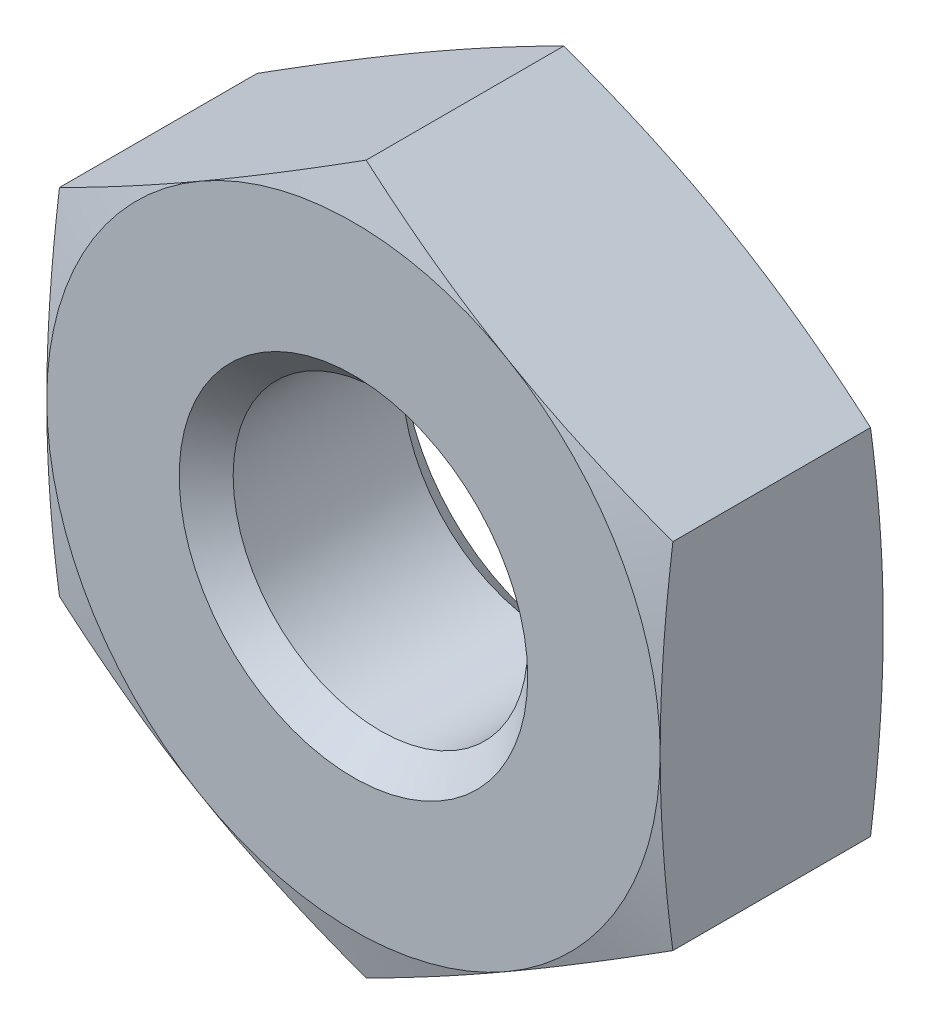
ISO-10303-21;
HEADER;
FILE_DESCRIPTION(('STEP AP214'),'2;1');
FILE_NAME('part.step','',(''),(''),'','','');
FILE_SCHEMA(('AUTOMOTIVE_DESIGN { 1 0 10303 214 1 1 1 1 }'));
ENDSEC;
DATA;
#1=APPLICATION_CONTEXT('core data for automotive mechanical design processes');
#2=APPLICATION_PROTOCOL_DEFINITION('international standard','automotive_design',2000,#1);
#3=PRODUCT_CONTEXT('',#1,'mechanical');
#4=PRODUCT('Part','Part','',(#3));
#5=PRODUCT_RELATED_PRODUCT_CATEGORY('part','',(#4));
#6=PRODUCT_DEFINITION_FORMATION('','',#4);
#7=PRODUCT_DEFINITION_CONTEXT('part definition',#1,'design');
#8=PRODUCT_DEFINITION('design','',#6,#7);
#9=PRODUCT_DEFINITION_SHAPE('','',#8);
#10=(LENGTH_UNIT() NAMED_UNIT(*) SI_UNIT(.MILLI.,.METRE.));
#11=(NAMED_UNIT(*) PLANE_ANGLE_UNIT() SI_UNIT($,.RADIAN.));
#12=(NAMED_UNIT(*) SI_UNIT($,.STERADIAN.) SOLID_ANGLE_UNIT());
#13=UNCERTAINTY_MEASURE_WITH_UNIT(LENGTH_MEASURE(1.E-05),#10,'distance_accuracy_value','');
#14=(GEOMETRIC_REPRESENTATION_CONTEXT(3) GLOBAL_UNCERTAINTY_ASSIGNED_CONTEXT((#13)) GLOBAL_UNIT_ASSIGNED_CONTEXT((#10,
#11,#12)) REPRESENTATION_CONTEXT('',''));
#15=CARTESIAN_POINT('',(0.,0.,0.));
#16=DIRECTION('',(0.,0.,1.));
#17=DIRECTION('',(1.,0.,0.));
#18=AXIS2_PLACEMENT_3D('',#15,#16,#17);
#19=CARTESIAN_POINT('',(0.,5.588,-4.064));
#20=DIRECTION('',(0.,0.,1.));
#21=DIRECTION('',(1.,0.,0.));
#22=AXIS2_PLACEMENT_3D('',#19,#20,#21);
#23=PLANE('',#22);
#24=CARTESIAN_POINT('',(0.,0.,-4.064000000026));
#25=DIRECTION('',(0.,0.,1.));
#26=DIRECTION('',(1.,0.,0.));
#27=AXIS2_PLACEMENT_3D('',#24,#25,#26);
#28=CIRCLE('',#27,5.58799999998882);
#29=CARTESIAN_POINT('',(2.7939999999972,4.83934995634261,-4.06400000002451));
#30=VERTEX_POINT('',#29);
#31=CARTESIAN_POINT('',(-2.7939999999972,4.8393499563426,-4.06400000002451));
#32=VERTEX_POINT('',#31);
#33=EDGE_CURVE('E130',#30,#32,#28,.T.);
#34=ORIENTED_EDGE('',*,*,#33,.F.);
#35=CARTESIAN_POINT('',(0.,0.,-4.064000000026));
#36=DIRECTION('',(0.,0.,1.));
#37=DIRECTION('',(1.,0.,0.));
#38=AXIS2_PLACEMENT_3D('',#35,#36,#37);
#39=CIRCLE('',#38,5.58799999998882);
#40=CARTESIAN_POINT('',(5.58799999999441,0.,-4.06400000002451));
#41=VERTEX_POINT('',#40);
#42=EDGE_CURVE('E127',#41,#30,#39,.T.);
#43=ORIENTED_EDGE('',*,*,#42,.F.);
#44=CARTESIAN_POINT('',(0.,0.,-4.064000000026));
#45=DIRECTION('',(0.,0.,1.));
#46=DIRECTION('',(1.,0.,0.));
#47=AXIS2_PLACEMENT_3D('',#44,#45,#46);
#48=CIRCLE('',#47,5.58799999998882);
#49=CARTESIAN_POINT('',(2.7939999999972,-4.83934995634261,-4.06400000002451));
#50=VERTEX_POINT('',#49);
#51=EDGE_CURVE('E19',#50,#41,#48,.T.);
#52=ORIENTED_EDGE('',*,*,#51,.F.);
#53=CARTESIAN_POINT('',(0.,0.,-4.064000000026));
#54=DIRECTION('',(0.,0.,1.));
#55=DIRECTION('',(1.,0.,0.));
#56=AXIS2_PLACEMENT_3D('',#53,#54,#55);
#57=CIRCLE('',#56,5.58799999998882);
#58=CARTESIAN_POINT('',(-2.7939999999972,-4.83934995634261,-4.06400000002451));
#59=VERTEX_POINT('',#58);
#60=EDGE_CURVE('E103',#59,#50,#57,.T.);
#61=ORIENTED_EDGE('',*,*,#60,.F.);
#62=CARTESIAN_POINT('',(0.,0.,-4.064000000026));
#63=DIRECTION('',(0.,0.,1.));
#64=DIRECTION('',(1.,0.,0.));
#65=AXIS2_PLACEMENT_3D('',#62,#63,#64);
#66=CIRCLE('',#65,5.58799999998882);
#67=CARTESIAN_POINT('',(-5.58799999999441,0.,-4.06400000002451));
#68=VERTEX_POINT('',#67);
#69=EDGE_CURVE('E135',#68,#59,#66,.T.);
#70=ORIENTED_EDGE('',*,*,#69,.F.);
#71=CARTESIAN_POINT('',(0.,0.,-4.064000000026));
#72=DIRECTION('',(0.,0.,1.));
#73=DIRECTION('',(1.,0.,0.));
#74=AXIS2_PLACEMENT_3D('',#71,#72,#73);
#75=CIRCLE('',#74,5.58799999998882);
#76=EDGE_CURVE('E411',#32,#68,#75,.T.);
#77=ORIENTED_EDGE('',*,*,#76,.F.);
#78=EDGE_LOOP('',(#34,#43,#52,#61,#70,#77));
#79=FACE_BOUND('',#78,.T.);
#80=CARTESIAN_POINT('',(0.,0.,-4.06400000002805));
#81=DIRECTION('',(0.,0.,-1.));
#82=DIRECTION('',(-1.,0.,0.));
#83=AXIS2_PLACEMENT_3D('',#80,#81,#82);
#84=CIRCLE('',#83,3.17499999999882);
#85=CARTESIAN_POINT('',(-3.17499999999882,0.,-4.06400000002805));
#86=VERTEX_POINT('',#85);
#87=EDGE_CURVE('E124',#86,#86,#84,.F.);
#88=ORIENTED_EDGE('',*,*,#87,.T.);
#89=EDGE_LOOP('',(#88));
#90=FACE_BOUND('',#89,.T.);
#91=ADVANCED_FACE('F16',(#79,#90),#23,.F.);
#92=CARTESIAN_POINT('',(0.,0.,-3.83097707165803));
#93=DIRECTION('',(0.,0.,1.));
#94=DIRECTION('',(1.,0.,0.));
#95=AXIS2_PLACEMENT_3D('',#92,#93,#94);
#96=CONICAL_SURFACE('',#95,6.45765340800608,1.30899693900135);
#97=CARTESIAN_POINT('',(2.79399999999999,-4.83934995634744,-4.06400000002301));
#98=CARTESIAN_POINT('',(2.91089048197917,-4.77186320511105,-4.06400613805041));
#99=CARTESIAN_POINT('',(3.02777767203443,-4.70437835446783,-4.06268908124278));
#100=CARTESIAN_POINT('',(3.26150490328894,-4.56943587458609,-4.0574605147276));
#101=CARTESIAN_POINT('',(3.3783449458841,-4.50197824454165,-4.05354908849101));
#102=CARTESIAN_POINT('',(3.72847238563638,-4.29983207295,-4.03801311347));
#103=CARTESIAN_POINT('',(3.96163987483682,-4.16521276029386,-4.02258663373282));
#104=CARTESIAN_POINT('',(4.42730452197151,-3.89636115091855,-3.98253825882312));
#105=CARTESIAN_POINT('',(4.65980182496363,-3.76212877045019,-3.95791853210183));
#106=CARTESIAN_POINT('',(5.12433854928225,-3.49392836761637,-3.90075946318869));
#107=CARTESIAN_POINT('',(5.35637714733395,-3.35996082056883,-3.86821113150756));
#108=CARTESIAN_POINT('',(5.58800000000257,-3.22623330423014,-3.8323668704064));
#109=B_SPLINE_CURVE_WITH_KNOTS('',3,(#97,#98,#99,#100,#101,#102,#103,#104,#105,#106,#107,#108),
.UNSPECIFIED.,.F.,.F.,(4,2,2,2,2,4),(0.,0.404906880860233,0.809800734922586,1.61864413081672,
2.42729686168546,3.23687074950759),.UNSPECIFIED.);
#110=CARTESIAN_POINT('',(5.58800000000161,-3.22623330423255,-3.8323668704063));
#111=VERTEX_POINT('',#110);
#112=EDGE_CURVE('E114',#50,#111,#109,.T.);
#113=ORIENTED_EDGE('',*,*,#112,.F.);
#114=ORIENTED_EDGE('',*,*,#51,.T.);
#115=CARTESIAN_POINT('',(5.58799999999305,-3.22623330423461,-3.83236687040081));
#116=CARTESIAN_POINT('',(5.58799999999751,-2.95877827155755,-3.86821113150552));
#117=CARTESIAN_POINT('',(5.58799999999933,-2.69084317746257,-3.9007594631881));
#118=CARTESIAN_POINT('',(5.58800000000067,-2.1544423717949,-3.95791853210232));
#119=CARTESIAN_POINT('',(5.58800000000018,-1.88597761085806,-3.98253825882323));
#120=CARTESIAN_POINT('',(5.58799999999983,-1.34827439210734,-4.02258663373267));
#121=CARTESIAN_POINT('',(5.58799999999997,-1.07903576679505,-4.03801311346996));
#122=CARTESIAN_POINT('',(5.58800000000002,-0.674743423611711,-4.05354908849102));
#123=CARTESIAN_POINT('',(5.58800000000001,-0.539828163522803,-4.05746051472761));
#124=CARTESIAN_POINT('',(5.58799999999999,-0.269943203759274,-4.06268908124277));
#125=CARTESIAN_POINT('',(5.58799999999998,-0.134973502472803,-4.0640061380504));
#126=CARTESIAN_POINT('',(5.588,0.,-4.06400000002301));
#127=B_SPLINE_CURVE_WITH_KNOTS('',3,(#115,#116,#117,#118,#119,#120,#121,#122,#123,#124,#125,
#126),.UNSPECIFIED.,.F.,.F.,(4,2,2,2,2,4),(0.,0.809573887822391,1.61822661869133,
2.42707001458552,2.83196386864794,3.23687074950825),.UNSPECIFIED.);
#128=EDGE_CURVE('E112',#111,#41,#127,.T.);
#129=ORIENTED_EDGE('',*,*,#128,.F.);
#130=EDGE_LOOP('',(#113,#114,#129));
#131=FACE_BOUND('',#130,.T.);
#132=ADVANCED_FACE('F111',(#131),#96,.T.);
#133=CARTESIAN_POINT('',(0.,0.,-3.83097707165803));
#134=DIRECTION('',(0.,0.,1.));
#135=DIRECTION('',(1.,0.,0.));
#136=AXIS2_PLACEMENT_3D('',#133,#134,#135);
#137=CONICAL_SURFACE('',#136,6.45765340800608,1.30899693900135);
#138=CARTESIAN_POINT('',(-2.794,-4.83934995634745,-4.06400000002301));
#139=CARTESIAN_POINT('',(-2.67710951802081,-4.90683670758384,-4.06400613805041));
#140=CARTESIAN_POINT('',(-2.56022232796556,-4.97432155822706,-4.06268908124278));
#141=CARTESIAN_POINT('',(-2.32649509671105,-5.1092640381088,-4.0574605147276));
#142=CARTESIAN_POINT('',(-2.20965505411589,-5.17672166815324,-4.05354908849101));
#143=CARTESIAN_POINT('',(-1.85952761436361,-5.37886783974489,-4.03801311347));
#144=CARTESIAN_POINT('',(-1.62636012516317,-5.51348715240103,-4.02258663373282));
#145=CARTESIAN_POINT('',(-1.16069547802849,-5.78233876177633,-3.98253825882312));
#146=CARTESIAN_POINT('',(-0.928198175036369,-5.9165711422447,-3.95791853210183));
#147=CARTESIAN_POINT('',(-0.46366145071775,-6.18477154507852,-3.90075946318868));
#148=CARTESIAN_POINT('',(-0.231622852666047,-6.31873909212605,-3.86821113150756));
#149=CARTESIAN_POINT('',(2.5725689760497E-12,-6.45246660846475,-3.8323668704064));
#150=B_SPLINE_CURVE_WITH_KNOTS('',3,(#138,#139,#140,#141,#142,#143,#144,#145,#146,#147,#148,
#149),.UNSPECIFIED.,.F.,.F.,(4,2,2,2,2,4),(0.,0.404906880860231,0.809800734922583,
1.61864413081671,2.42729686168545,3.23687074950758),.UNSPECIFIED.);
#151=CARTESIAN_POINT('',(0.,-6.45246660846511,-3.8323668704063));
#152=VERTEX_POINT('',#151);
#153=EDGE_CURVE('E275',#59,#152,#150,.T.);
#154=ORIENTED_EDGE('',*,*,#153,.F.);
#155=ORIENTED_EDGE('',*,*,#60,.T.);
#156=CARTESIAN_POINT('',(-6.06003807704887E-12,-6.45246660845872,-3.83236687040082));
#157=CARTESIAN_POINT('',(0.231622852664497,-6.31873909212406,-3.86821113150552));
#158=CARTESIAN_POINT('',(0.463661450717038,-6.18477154507814,-3.9007594631881));
#159=CARTESIAN_POINT('',(0.928198175036345,-5.91657114224546,-3.95791853210233));
#160=CARTESIAN_POINT('',(1.16069547802832,-5.78233876177662,-3.98253825882324));
#161=CARTESIAN_POINT('',(1.62636012516292,-5.51348715240096,-4.02258663373267));
#162=CARTESIAN_POINT('',(1.85952761436344,-5.37886783974494,-4.03801311346997));
#163=CARTESIAN_POINT('',(2.20965505411577,-5.17672166815331,-4.05354908849102));
#164=CARTESIAN_POINT('',(2.32649509671095,-5.10926403810885,-4.05746051472761));
#165=CARTESIAN_POINT('',(2.56022232796549,-4.97432155822707,-4.06268908124278));
#166=CARTESIAN_POINT('',(2.67710951802077,-4.90683670758383,-4.0640061380504));
#167=CARTESIAN_POINT('',(2.79399999999999,-4.83934995634744,-4.06400000002301));
#168=B_SPLINE_CURVE_WITH_KNOTS('',3,(#156,#157,#158,#159,#160,#161,#162,#163,#164,#165,#166,
#167),.UNSPECIFIED.,.F.,.F.,(4,2,2,2,2,4),(0.,0.809573887822391,1.61822661869133,
2.42707001458551,2.83196386864793,3.23687074950825),.UNSPECIFIED.);
#169=EDGE_CURVE('E139',#152,#50,#168,.T.);
#170=ORIENTED_EDGE('',*,*,#169,.F.);
#171=EDGE_LOOP('',(#154,#155,#170));
#172=FACE_BOUND('',#171,.T.);
#173=ADVANCED_FACE('F288',(#172),#137,.T.);
#174=CARTESIAN_POINT('',(0.,0.,-3.83097707165803));
#175=DIRECTION('',(0.,0.,1.));
#176=DIRECTION('',(1.,0.,0.));
#177=AXIS2_PLACEMENT_3D('',#174,#175,#176);
#178=CONICAL_SURFACE('',#177,6.45765340800608,1.30899693900135);
#179=ORIENTED_EDGE('',*,*,#69,.T.);
#180=CARTESIAN_POINT('',(-5.5879999999991,-3.22623330422413,-3.83236687040081));
#181=CARTESIAN_POINT('',(-5.35637714733301,-3.35996082056652,-3.86821113150551));
#182=CARTESIAN_POINT('',(-5.12433854928229,-3.49392836761559,-3.9007594631881));
#183=CARTESIAN_POINT('',(-4.65980182496431,-3.76212877045058,-3.95791853210232));
#184=CARTESIAN_POINT('',(-4.42730452197185,-3.89636115091857,-3.98253825882323));
#185=CARTESIAN_POINT('',(-3.96163987483689,-4.16521276029363,-4.02258663373267));
#186=CARTESIAN_POINT('',(-3.72847238563652,-4.29983207294989,-4.03801311346996));
#187=CARTESIAN_POINT('',(-3.37834494588424,-4.50197824454161,-4.05354908849102));
#188=CARTESIAN_POINT('',(-3.26150490328905,-4.56943587458606,-4.05746051472761));
#189=CARTESIAN_POINT('',(-3.02777767203448,-4.70437835446781,-4.06268908124277));
#190=CARTESIAN_POINT('',(-2.9108904819792,-4.77186320511103,-4.0640061380504));
#191=CARTESIAN_POINT('',(-2.794,-4.83934995634745,-4.06400000002301));
#192=B_SPLINE_CURVE_WITH_KNOTS('',3,(#180,#181,#182,#183,#184,#185,#186,#187,#188,#189,#190,
#191),.UNSPECIFIED.,.F.,.F.,(4,2,2,2,2,4),(0.,0.809573887822391,1.61822661869133,
2.42707001458552,2.83196386864794,3.23687074950825),.UNSPECIFIED.);
#193=CARTESIAN_POINT('',(-5.58800000000161,-3.22623330423256,-3.8323668704063));
#194=VERTEX_POINT('',#193);
#195=EDGE_CURVE('E280',#194,#59,#192,.T.);
#196=ORIENTED_EDGE('',*,*,#195,.F.);
#197=CARTESIAN_POINT('',(-5.588,0.,-4.06400000002301));
#198=CARTESIAN_POINT('',(-5.588,-0.134973502472776,-4.06400613805041));
#199=CARTESIAN_POINT('',(-5.588,-0.269943203759218,-4.06268908124278));
#200=CARTESIAN_POINT('',(-5.588,-0.539828163522696,-4.0574605147276));
#201=CARTESIAN_POINT('',(-5.588,-0.674743423611582,-4.05354908849101));
#202=CARTESIAN_POINT('',(-5.588,-1.07903576679489,-4.03801311347));
#203=CARTESIAN_POINT('',(-5.588,-1.34827439210717,-4.02258663373282));
#204=CARTESIAN_POINT('',(-5.588,-1.88597761085778,-3.98253825882312));
#205=CARTESIAN_POINT('',(-5.588,-2.1544423717945,-3.95791853210183));
#206=CARTESIAN_POINT('',(-5.588,-2.69084317746215,-3.90075946318868));
#207=CARTESIAN_POINT('',(-5.588,-2.95877827155722,-3.86821113150756));
#208=CARTESIAN_POINT('',(-5.588,-3.22623330423461,-3.8323668704064));
#209=B_SPLINE_CURVE_WITH_KNOTS('',3,(#197,#198,#199,#200,#201,#202,#203,#204,#205,#206,#207,
#208),.UNSPECIFIED.,.F.,.F.,(4,2,2,2,2,4),(0.,0.404906880860233,0.809800734922587,
1.61864413081672,2.42729686168547,3.23687074950759),.UNSPECIFIED.);
#210=EDGE_CURVE('E182',#68,#194,#209,.T.);
#211=ORIENTED_EDGE('',*,*,#210,.F.);
#212=EDGE_LOOP('',(#179,#196,#211));
#213=FACE_BOUND('',#212,.T.);
#214=ADVANCED_FACE('F164',(#213),#178,.T.);
#215=CARTESIAN_POINT('',(0.,0.,-3.83097707165803));
#216=DIRECTION('',(0.,0.,1.));
#217=DIRECTION('',(1.,0.,0.));
#218=AXIS2_PLACEMENT_3D('',#215,#216,#217);
#219=CONICAL_SURFACE('',#218,6.45765340800608,1.30899693900135);
#220=CARTESIAN_POINT('',(5.588,0.,-4.06400000002301));
#221=CARTESIAN_POINT('',(5.588,0.134973502472776,-4.06400613805041));
#222=CARTESIAN_POINT('',(5.588,0.269943203759219,-4.06268908124278));
#223=CARTESIAN_POINT('',(5.588,0.539828163522697,-4.0574605147276));
#224=CARTESIAN_POINT('',(5.588,0.674743423611582,-4.05354908849101));
#225=CARTESIAN_POINT('',(5.588,1.07903576679489,-4.03801311347));
#226=CARTESIAN_POINT('',(5.588,1.34827439210717,-4.02258663373282));
#227=CARTESIAN_POINT('',(5.588,1.88597761085778,-3.98253825882312));
#228=CARTESIAN_POINT('',(5.588,2.1544423717945,-3.95791853210183));
#229=CARTESIAN_POINT('',(5.588,2.69084317746215,-3.90075946318868));
#230=CARTESIAN_POINT('',(5.588,2.95877827155722,-3.86821113150756));
#231=CARTESIAN_POINT('',(5.588,3.22623330423461,-3.8323668704064));
#232=B_SPLINE_CURVE_WITH_KNOTS('',3,(#220,#221,#222,#223,#224,#225,#226,#227,#228,#229,#230,
#231),.UNSPECIFIED.,.F.,.F.,(4,2,2,2,2,4),(0.,0.404906880860234,0.809800734922587,
1.61864413081672,2.42729686168547,3.23687074950759),.UNSPECIFIED.);
#233=CARTESIAN_POINT('',(5.588,3.22623330423349,-3.83236687040655));
#234=VERTEX_POINT('',#233);
#235=EDGE_CURVE('E120',#41,#234,#232,.T.);
#236=ORIENTED_EDGE('',*,*,#235,.F.);
#237=ORIENTED_EDGE('',*,*,#42,.T.);
#238=CARTESIAN_POINT('',(5.5879999999991,3.22623330422413,-3.83236687040081));
#239=CARTESIAN_POINT('',(5.356377147333,3.35996082056652,-3.86821113150551));
#240=CARTESIAN_POINT('',(5.12433854928229,3.49392836761559,-3.9007594631881));
#241=CARTESIAN_POINT('',(4.65980182496431,3.76212877045058,-3.95791853210232));
#242=CARTESIAN_POINT('',(4.42730452197185,3.89636115091857,-3.98253825882323));
#243=CARTESIAN_POINT('',(3.96163987483689,4.16521276029363,-4.02258663373267));
#244=CARTESIAN_POINT('',(3.72847238563652,4.29983207294989,-4.03801311346996));
#245=CARTESIAN_POINT('',(3.37834494588423,4.50197824454161,-4.05354908849102));
#246=CARTESIAN_POINT('',(3.26150490328905,4.56943587458606,-4.05746051472761));
#247=CARTESIAN_POINT('',(3.02777767203448,4.70437835446781,-4.06268908124277));
#248=CARTESIAN_POINT('',(2.9108904819792,4.77186320511104,-4.0640061380504));
#249=CARTESIAN_POINT('',(2.794,4.83934995634745,-4.06400000002301));
#250=B_SPLINE_CURVE_WITH_KNOTS('',3,(#238,#239,#240,#241,#242,#243,#244,#245,#246,#247,#248,
#249),.UNSPECIFIED.,.F.,.F.,(4,2,2,2,2,4),(0.,0.809573887822392,1.61822661869133,
2.42707001458552,2.83196386864794,3.23687074950826),.UNSPECIFIED.);
#251=EDGE_CURVE('E138',#234,#30,#250,.T.);
#252=ORIENTED_EDGE('',*,*,#251,.F.);
#253=EDGE_LOOP('',(#236,#237,#252));
#254=FACE_BOUND('',#253,.T.);
#255=ADVANCED_FACE('F137',(#254),#219,.T.);
#256=CARTESIAN_POINT('',(0.,0.,-3.83097707165803));
#257=DIRECTION('',(0.,0.,1.));
#258=DIRECTION('',(1.,0.,0.));
#259=AXIS2_PLACEMENT_3D('',#256,#257,#258);
#260=CONICAL_SURFACE('',#259,6.45765340800608,1.30899693900135);
#261=CARTESIAN_POINT('',(2.794,4.83934995634745,-4.06400000002301));
#262=CARTESIAN_POINT('',(2.67710951802081,4.90683670758384,-4.06400613805041));
#263=CARTESIAN_POINT('',(2.56022232796556,4.97432155822706,-4.06268908124278));
#264=CARTESIAN_POINT('',(2.32649509671104,5.1092640381088,-4.0574605147276));
#265=CARTESIAN_POINT('',(2.20965505411589,5.17672166815324,-4.05354908849101));
#266=CARTESIAN_POINT('',(1.85952761436361,5.37886783974489,-4.03801311347));
#267=CARTESIAN_POINT('',(1.62636012516317,5.51348715240103,-4.02258663373282));
#268=CARTESIAN_POINT('',(1.16069547802849,5.78233876177633,-3.98253825882312));
#269=CARTESIAN_POINT('',(0.928198175036368,5.9165711422447,-3.95791853210183));
#270=CARTESIAN_POINT('',(0.463661450717749,6.18477154507852,-3.90075946318868));
#271=CARTESIAN_POINT('',(0.231622852666046,6.31873909212605,-3.86821113150756));
#272=CARTESIAN_POINT('',(-2.57232619679129E-12,6.45246660846475,-3.8323668704064));
#273=B_SPLINE_CURVE_WITH_KNOTS('',3,(#261,#262,#263,#264,#265,#266,#267,#268,#269,#270,#271,
#272),.UNSPECIFIED.,.F.,.F.,(4,2,2,2,2,4),(0.,0.404906880860231,0.809800734922582,
1.61864413081671,2.42729686168545,3.23687074950757),.UNSPECIFIED.);
#274=CARTESIAN_POINT('',(-1.60443338014632E-12,6.45246660846418,-3.83236687040655));
#275=VERTEX_POINT('',#274);
#276=EDGE_CURVE('E176',#30,#275,#273,.T.);
#277=ORIENTED_EDGE('',*,*,#276,.F.);
#278=ORIENTED_EDGE('',*,*,#33,.T.);
#279=CARTESIAN_POINT('',(6.05815025700102E-12,6.45246660845872,-3.83236687040082));
#280=CARTESIAN_POINT('',(-0.231622852664499,6.31873909212405,-3.86821113150552));
#281=CARTESIAN_POINT('',(-0.46366145071704,6.18477154507814,-3.9007594631881));
#282=CARTESIAN_POINT('',(-0.928198175036347,5.91657114224546,-3.95791853210233));
#283=CARTESIAN_POINT('',(-1.16069547802832,5.78233876177662,-3.98253825882324));
#284=CARTESIAN_POINT('',(-1.62636012516292,5.51348715240096,-4.02258663373267));
#285=CARTESIAN_POINT('',(-1.85952761436344,5.37886783974494,-4.03801311346997));
#286=CARTESIAN_POINT('',(-2.20965505411577,5.17672166815331,-4.05354908849102));
#287=CARTESIAN_POINT('',(-2.32649509671095,5.10926403810885,-4.05746051472761));
#288=CARTESIAN_POINT('',(-2.5602223279655,4.97432155822707,-4.06268908124278));
#289=CARTESIAN_POINT('',(-2.67710951802077,4.90683670758383,-4.0640061380504));
#290=CARTESIAN_POINT('',(-2.79399999999999,4.83934995634744,-4.06400000002301));
#291=B_SPLINE_CURVE_WITH_KNOTS('',3,(#279,#280,#281,#282,#283,#284,#285,#286,#287,#288,#289,
#290),.UNSPECIFIED.,.F.,.F.,(4,2,2,2,2,4),(0.,0.80957388782239,1.61822661869133,
2.42707001458551,2.83196386864793,3.23687074950825),.UNSPECIFIED.);
#292=EDGE_CURVE('E342',#275,#32,#291,.T.);
#293=ORIENTED_EDGE('',*,*,#292,.F.);
#294=EDGE_LOOP('',(#277,#278,#293));
#295=FACE_BOUND('',#294,.T.);
#296=ADVANCED_FACE('F163',(#295),#260,.T.);
#297=CARTESIAN_POINT('',(0.,0.,-3.83097707165803));
#298=DIRECTION('',(0.,0.,1.));
#299=DIRECTION('',(1.,0.,0.));
#300=AXIS2_PLACEMENT_3D('',#297,#298,#299);
#301=CONICAL_SURFACE('',#300,6.45765340800608,1.30899693900135);
#302=ORIENTED_EDGE('',*,*,#76,.T.);
#303=CARTESIAN_POINT('',(-5.58799999999305,3.22623330423461,-3.83236687040081));
#304=CARTESIAN_POINT('',(-5.58799999999751,2.95877827155755,-3.86821113150552));
#305=CARTESIAN_POINT('',(-5.58799999999933,2.69084317746257,-3.9007594631881));
#306=CARTESIAN_POINT('',(-5.58800000000067,2.1544423717949,-3.95791853210232));
#307=CARTESIAN_POINT('',(-5.58800000000018,1.88597761085806,-3.98253825882323));
#308=CARTESIAN_POINT('',(-5.58799999999983,1.34827439210734,-4.02258663373267));
#309=CARTESIAN_POINT('',(-5.58799999999997,1.07903576679505,-4.03801311346996));
#310=CARTESIAN_POINT('',(-5.58800000000002,0.674743423611712,-4.05354908849102));
#311=CARTESIAN_POINT('',(-5.58800000000001,0.539828163522803,-4.05746051472761));
#312=CARTESIAN_POINT('',(-5.58799999999999,0.269943203759274,-4.06268908124277));
#313=CARTESIAN_POINT('',(-5.58799999999998,0.134973502472803,-4.0640061380504));
#314=CARTESIAN_POINT('',(-5.588,0.,-4.06400000002301));
#315=B_SPLINE_CURVE_WITH_KNOTS('',3,(#303,#304,#305,#306,#307,#308,#309,#310,#311,#312,#313,
#314),.UNSPECIFIED.,.F.,.F.,(4,2,2,2,2,4),(0.,0.809573887822391,1.61822661869133,
2.42707001458552,2.83196386864794,3.23687074950825),.UNSPECIFIED.);
#316=CARTESIAN_POINT('',(-5.58800000000161,3.22623330423256,-3.8323668704063));
#317=VERTEX_POINT('',#316);
#318=EDGE_CURVE('E281',#317,#68,#315,.T.);
#319=ORIENTED_EDGE('',*,*,#318,.F.);
#320=CARTESIAN_POINT('',(-2.79399999999999,4.83934995634744,-4.06400000002301));
#321=CARTESIAN_POINT('',(-2.91089048197918,4.77186320511105,-4.06400613805041));
#322=CARTESIAN_POINT('',(-3.02777767203443,4.70437835446783,-4.06268908124278));
#323=CARTESIAN_POINT('',(-3.26150490328894,4.56943587458609,-4.0574605147276));
#324=CARTESIAN_POINT('',(-3.37834494588411,4.50197824454165,-4.05354908849101));
#325=CARTESIAN_POINT('',(-3.72847238563639,4.29983207295,-4.03801311347));
#326=CARTESIAN_POINT('',(-3.96163987483682,4.16521276029385,-4.02258663373282));
#327=CARTESIAN_POINT('',(-4.42730452197151,3.89636115091855,-3.98253825882312));
#328=CARTESIAN_POINT('',(-4.65980182496363,3.76212877045019,-3.95791853210183));
#329=CARTESIAN_POINT('',(-5.12433854928225,3.49392836761637,-3.90075946318869));
#330=CARTESIAN_POINT('',(-5.35637714733395,3.35996082056883,-3.86821113150756));
#331=CARTESIAN_POINT('',(-5.58800000000257,3.22623330423014,-3.8323668704064));
#332=B_SPLINE_CURVE_WITH_KNOTS('',3,(#320,#321,#322,#323,#324,#325,#326,#327,#328,#329,#330,
#331),.UNSPECIFIED.,.F.,.F.,(4,2,2,2,2,4),(0.,0.404906880860233,0.809800734922585,
1.61864413081672,2.42729686168546,3.23687074950759),.UNSPECIFIED.);
#333=EDGE_CURVE('E338',#32,#317,#332,.T.);
#334=ORIENTED_EDGE('',*,*,#333,.F.);
#335=EDGE_LOOP('',(#302,#319,#334));
#336=FACE_BOUND('',#335,.T.);
#337=ADVANCED_FACE('F417',(#336),#301,.T.);
#338=CARTESIAN_POINT('',(0.,0.,-4.06400000002805));
#339=DIRECTION('',(0.,0.,-1.));
#340=DIRECTION('',(-1.,0.,0.));
#341=AXIS2_PLACEMENT_3D('',#338,#339,#340);
#342=CONICAL_SURFACE('',#341,3.17499999999882,0.785398163397448);
#343=CARTESIAN_POINT('',(0.,0.,-3.57251));
#344=DIRECTION('',(0.,0.,1.));
#345=DIRECTION('',(1.,0.,0.));
#346=AXIS2_PLACEMENT_3D('',#343,#344,#345);
#347=CIRCLE('',#346,2.68351);
#348=CARTESIAN_POINT('',(2.68351,0.,-3.57251));
#349=VERTEX_POINT('',#348);
#350=EDGE_CURVE('E331',#349,#349,#347,.T.);
#351=ORIENTED_EDGE('',*,*,#350,.T.);
#352=EDGE_LOOP('',(#351));
#353=FACE_BOUND('',#352,.T.);
#354=ORIENTED_EDGE('',*,*,#87,.F.);
#355=EDGE_LOOP('',(#354));
#356=FACE_BOUND('',#355,.T.);
#357=ADVANCED_FACE('F415',(#353,#356),#342,.F.);
#358=CARTESIAN_POINT('',(5.588,-3.22623330423164,-4.064));
#359=DIRECTION('',(1.,0.,0.));
#360=DIRECTION('',(0.,0.,-1.));
#361=AXIS2_PLACEMENT_3D('',#358,#359,#360);
#362=PLANE('',#361);
#363=ORIENTED_EDGE('',*,*,#235,.T.);
#364=DIRECTION('',(0.,0.,1.));
#365=VECTOR('',#364,1.);
#366=CARTESIAN_POINT('',(5.588,3.22623330423164,-4.064));
#367=LINE('',#366,#365);
#368=CARTESIAN_POINT('',(5.588,3.22623332711371,-0.231633132658444));
#369=VERTEX_POINT('',#368);
#370=EDGE_CURVE('E177',#369,#234,#367,.F.);
#371=ORIENTED_EDGE('',*,*,#370,.F.);
#372=CARTESIAN_POINT('',(5.588,0.,2.33865474576924E-11));
#373=CARTESIAN_POINT('',(5.588,0.134973504400605,6.13805113475887E-06));
#374=CARTESIAN_POINT('',(5.588,0.269943207614708,-0.00131091879430666));
#375=CARTESIAN_POINT('',(5.588,0.53982817123107,-0.00653948545847716));
#376=CARTESIAN_POINT('',(5.588,0.67474343324518,-0.0104509118062404));
#377=CARTESIAN_POINT('',(5.588,1.07903578218717,-0.0259868872658269));
#378=CARTESIAN_POINT('',(5.588,1.34827441132708,-0.0414133674354804));
#379=CARTESIAN_POINT('',(5.588,1.88597763770162,-0.0814617434389431));
#380=CARTESIAN_POINT('',(5.588,2.15444240243468,-0.10608147082137));
#381=CARTESIAN_POINT('',(5.588,2.69084321567823,-0.163240541226211));
#382=CARTESIAN_POINT('',(5.588,2.95877831355282,-0.195788873738281));
#383=CARTESIAN_POINT('',(5.588,3.22623334999578,-0.231633135724061));
#384=B_SPLINE_CURVE_WITH_KNOTS('',3,(#372,#373,#374,#375,#376,#377,#378,#379,#380,#381,#382,
#383),.UNSPECIFIED.,.F.,.F.,(4,2,2,2,2,4),(0.,0.404906886643133,0.809800746487453,
1.61864415391211,2.4272968962998,3.2368707956737),.UNSPECIFIED.);
#385=CARTESIAN_POINT('',(5.58799999999441,0.,2.48838229923133E-11));
#386=VERTEX_POINT('',#385);
#387=EDGE_CURVE('E388',#386,#369,#384,.T.);
#388=ORIENTED_EDGE('',*,*,#387,.F.);
#389=CARTESIAN_POINT('',(5.588,-3.22623320762845,-0.231633116650456));
#390=CARTESIAN_POINT('',(5.588,-2.95877818290053,-0.195788857416812));
#391=CARTESIAN_POINT('',(5.588,-2.69084309678439,-0.163240527489882));
#392=CARTESIAN_POINT('',(5.588,-2.15444230711019,-0.106081461725849));
#393=CARTESIAN_POINT('',(5.588,-1.88597755418789,-0.0814617364002843));
#394=CARTESIAN_POINT('',(5.588,-1.34827435153214,-0.0414133637996232));
#395=CARTESIAN_POINT('',(5.588,-1.07903573430032,-0.0259868849754276));
#396=CARTESIAN_POINT('',(5.588,-0.674743403274144,-0.0104509108802863));
#397=CARTESIAN_POINT('',(5.588,-0.53982814724959,-0.00653948487839538));
#398=CARTESIAN_POINT('',(5.588,-0.269943195619917,-0.00131091867774982));
#399=CARTESIAN_POINT('',(5.588,-0.134973498402948,6.1380500611794E-06));
#400=CARTESIAN_POINT('',(5.588,0.,2.33865134630576E-11));
#401=B_SPLINE_CURVE_WITH_KNOTS('',3,(#389,#390,#391,#392,#393,#394,#395,#396,#397,#398,#399,
#400),.UNSPECIFIED.,.F.,.F.,(4,2,2,2,2,4),(0.,0.809573863435232,1.61822656998641,
2.4270699415385,2.83196378339457,3.23687065204656),.UNSPECIFIED.);
#402=CARTESIAN_POINT('',(5.58800001980971,-3.22623329279448,-0.231633132657398));
#403=VERTEX_POINT('',#402);
#404=EDGE_CURVE('E365',#403,#386,#401,.T.);
#405=ORIENTED_EDGE('',*,*,#404,.F.);
#406=DIRECTION('',(0.,0.,1.));
#407=VECTOR('',#406,1.);
#408=CARTESIAN_POINT('',(5.58799999999999,-3.22623330423162,-4.064));
#409=LINE('',#408,#407);
#410=EDGE_CURVE('E123',#111,#403,#409,.T.);
#411=ORIENTED_EDGE('',*,*,#410,.F.);
#412=ORIENTED_EDGE('',*,*,#128,.T.);
#413=EDGE_LOOP('',(#363,#371,#388,#405,#411,#412));
#414=FACE_BOUND('',#413,.T.);
#415=ADVANCED_FACE('F118',(#414),#362,.T.);
#416=CARTESIAN_POINT('',(0.,-6.45246660846325,-4.064));
#417=DIRECTION('',(0.5,-0.866025403784439,0.));
#418=DIRECTION('',(0.866025403784439,0.5,0.));
#419=AXIS2_PLACEMENT_3D('',#416,#417,#418);
#420=PLANE('',#419);
#421=ORIENTED_EDGE('',*,*,#112,.T.);
#422=ORIENTED_EDGE('',*,*,#410,.T.);
#423=CARTESIAN_POINT('',(2.79399999999999,-4.83934995634744,2.33884021902709E-11));
#424=CARTESIAN_POINT('',(2.91089048364816,-4.77186320414746,6.13805113670551E-06));
#425=CARTESIAN_POINT('',(3.02777767537225,-4.70437835254074,-0.00131091879429178));
#426=CARTESIAN_POINT('',(3.26150490996232,-4.56943587073322,-0.00653948545841156));
#427=CARTESIAN_POINT('',(3.37834495422421,-4.50197823972649,-0.010450911806137));
#428=CARTESIAN_POINT('',(3.72847239896196,-4.29983206525647,-0.0259868872655743));
#429=CARTESIAN_POINT('',(3.96163989147608,-4.16521275068717,-0.0414133674350804));
#430=CARTESIAN_POINT('',(4.42730454521104,-3.8963611375012,-0.0814617434381707));
#431=CARTESIAN_POINT('',(4.65980185148976,-3.76212875513532,-0.106081470820373));
#432=CARTESIAN_POINT('',(5.12433858236708,-3.49392834851483,-0.163240541224705));
#433=CARTESIAN_POINT('',(5.35637718369083,-3.35996079957818,-0.195788873736493));
#434=CARTESIAN_POINT('',(5.58800003961941,-3.22623328135734,-0.231633135721971));
#435=B_SPLINE_CURVE_WITH_KNOTS('',3,(#423,#424,#425,#426,#427,#428,#429,#430,#431,#432,#433,
#434),.UNSPECIFIED.,.F.,.F.,(4,2,2,2,2,4),(0.,0.404906886641165,0.809800746483515,
1.61864415390425,2.42729689628801,3.23687079565798),.UNSPECIFIED.);
#436=CARTESIAN_POINT('',(2.7939999999972,-4.8393499563426,2.48848454715631E-11));
#437=VERTEX_POINT('',#436);
#438=EDGE_CURVE('E364',#437,#403,#435,.T.);
#439=ORIENTED_EDGE('',*,*,#438,.F.);
#440=CARTESIAN_POINT('',(8.36753202976915E-08,-6.45246656014915,-0.231633116650801));
#441=CARTESIAN_POINT('',(0.231622929459149,-6.31873904778804,-0.1957888574157));
#442=CARTESIAN_POINT('',(0.463661520599986,-6.18477150473158,-0.163240527488363));
#443=CARTESIAN_POINT('',(0.928198231065524,-5.91657110989663,-0.106081461724391));
#444=CARTESIAN_POINT('',(1.16069552711553,-5.78233873343601,-0.0814617363992919));
#445=CARTESIAN_POINT('',(1.6263601603089,-5.51348713210952,-0.0414133637992178));
#446=CARTESIAN_POINT('',(1.85952764251012,-5.37886782349446,-0.0259868849751417));
#447=CARTESIAN_POINT('',(2.209655071732,-5.17672165798257,-0.010450910880157));
#448=CARTESIAN_POINT('',(2.32649511080666,-5.10926402997068,-0.00653948487831448));
#449=CARTESIAN_POINT('',(2.56022233501574,-4.97432155415661,-0.00131091867773609));
#450=CARTESIAN_POINT('',(2.67710952154605,-4.90683670554851,6.13805005609877E-06));
#451=CARTESIAN_POINT('',(2.79399999999999,-4.83934995634744,2.33884704347056E-11));
#452=B_SPLINE_CURVE_WITH_KNOTS('',3,(#440,#441,#442,#443,#444,#445,#446,#447,#448,#449,#450,
#451),.UNSPECIFIED.,.F.,.F.,(4,2,2,2,2,4),(0.,0.809573863430616,1.61822656997715,
2.42706994152453,2.83196378337826,3.2368706520279),.UNSPECIFIED.);
#453=CARTESIAN_POINT('',(1.98176945610757E-08,-6.45246661990501,-0.231633132658637));
#454=VERTEX_POINT('',#453);
#455=EDGE_CURVE('E362',#454,#437,#452,.T.);
#456=ORIENTED_EDGE('',*,*,#455,.F.);
#457=DIRECTION('',(0.,0.,1.));
#458=VECTOR('',#457,1.);
#459=CARTESIAN_POINT('',(0.,-6.45246660846326,-4.064));
#460=LINE('',#459,#458);
#461=EDGE_CURVE('E279',#152,#454,#460,.T.);
#462=ORIENTED_EDGE('',*,*,#461,.F.);
#463=ORIENTED_EDGE('',*,*,#169,.T.);
#464=EDGE_LOOP('',(#421,#422,#439,#456,#462,#463));
#465=FACE_BOUND('',#464,.T.);
#466=ADVANCED_FACE('F262',(#465),#420,.T.);
#467=CARTESIAN_POINT('',(-5.588,-3.22623330423164,-4.064));
#468=DIRECTION('',(-0.5,-0.866025403784439,0.));
#469=DIRECTION('',(0.866025403784439,-0.5,0.));
#470=AXIS2_PLACEMENT_3D('',#467,#468,#469);
#471=PLANE('',#470);
#472=ORIENTED_EDGE('',*,*,#153,.T.);
#473=ORIENTED_EDGE('',*,*,#461,.T.);
#474=CARTESIAN_POINT('',(-2.794,-4.83934995634745,2.33846090192839E-11));
#475=CARTESIAN_POINT('',(-2.67710951635116,-4.90683670854782,6.13805113301508E-06));
#476=CARTESIAN_POINT('',(-2.56022232462639,-4.97432156015493,-0.00131091879431074));
#477=CARTESIAN_POINT('',(-2.32649509003498,-5.10926404196323,-0.0065394854584906));
#478=CARTESIAN_POINT('',(-2.20965504577242,-5.17672167297034,-0.0104509118062609));
#479=CARTESIAN_POINT('',(-1.85952760103266,-5.37886784744152,-0.0259868872658749));
#480=CARTESIAN_POINT('',(-1.6263601085172,-5.51348716201159,-0.0414133674355554));
#481=CARTESIAN_POINT('',(-1.16069545477958,-5.7823387751991,-0.0814617434390865));
#482=CARTESIAN_POINT('',(-0.928198148499533,-5.91657115756575,-0.106081470821555));
#483=CARTESIAN_POINT('',(-0.463661417619576,-6.18477156418776,-0.163240541226489));
#484=CARTESIAN_POINT('',(-0.231622816294507,-6.31873911312517,-0.195788873738611));
#485=CARTESIAN_POINT('',(3.96353940700518E-08,-6.45246663134677,-0.231633135724445));
#486=B_SPLINE_CURVE_WITH_KNOTS('',3,(#474,#475,#476,#477,#478,#479,#480,#481,#482,#483,#484,
#485),.UNSPECIFIED.,.F.,.F.,(4,2,2,2,2,4),(0.,0.404906886643494,0.809800746488175,
1.61864415391355,2.42729689630196,3.23687079567658),.UNSPECIFIED.);
#487=CARTESIAN_POINT('',(-2.7939999999972,-4.83934995634261,2.48829769472867E-11));
#488=VERTEX_POINT('',#487);
#489=EDGE_CURVE('E269',#488,#454,#486,.T.);
#490=ORIENTED_EDGE('',*,*,#489,.F.);
#491=CARTESIAN_POINT('',(-5.58800003963624,-3.22623328134764,-0.231633135724576));
#492=CARTESIAN_POINT('',(-5.35637718370627,-3.35996079956928,-0.195788873738723));
#493=CARTESIAN_POINT('',(-5.12433858238113,-3.49392834850673,-0.163240541226582));
#494=CARTESIAN_POINT('',(-4.65980185150103,-3.76212875512883,-0.106081470821617));
#495=CARTESIAN_POINT('',(-4.42730454522091,-3.89636113749552,-0.0814617434391345));
#496=CARTESIAN_POINT('',(-3.96163989148315,-4.16521275068311,-0.0414133674355798));
#497=CARTESIAN_POINT('',(-3.72847239896762,-4.29983206525322,-0.0259868872658899));
#498=CARTESIAN_POINT('',(-3.37834495422775,-4.50197823972446,-0.0104509118062667));
#499=CARTESIAN_POINT('',(-3.26150490996516,-4.5694358707316,-0.00653948545849419));
#500=CARTESIAN_POINT('',(-3.02777767537367,-4.70437835253994,-0.00131091879431141));
#501=CARTESIAN_POINT('',(-2.91089048364887,-4.77186320414707,6.13805113305119E-06));
#502=CARTESIAN_POINT('',(-2.794,-4.83934995634745,2.33847092281487E-11));
#503=B_SPLINE_CURVE_WITH_KNOTS('',3,(#491,#492,#493,#494,#495,#496,#497,#498,#499,#500,#501,
#502),.UNSPECIFIED.,.F.,.F.,(4,2,2,2,2,4),(0.,0.809573899374868,1.61822664176352,
2.42707004918915,2.83196390903396,3.23687079567758),.UNSPECIFIED.);
#504=CARTESIAN_POINT('',(-5.588,-3.22623325592034,-0.231633123120341));
#505=VERTEX_POINT('',#504);
#506=EDGE_CURVE('E249',#505,#488,#503,.T.);
#507=ORIENTED_EDGE('',*,*,#506,.F.);
#508=DIRECTION('',(0.,0.,1.));
#509=VECTOR('',#508,1.);
#510=CARTESIAN_POINT('',(-5.588,-3.22623330423164,-4.064));
#511=LINE('',#510,#509);
#512=EDGE_CURVE('E343',#194,#505,#511,.T.);
#513=ORIENTED_EDGE('',*,*,#512,.F.);
#514=ORIENTED_EDGE('',*,*,#195,.T.);
#515=EDGE_LOOP('',(#472,#473,#490,#507,#513,#514));
#516=FACE_BOUND('',#515,.T.);
#517=ADVANCED_FACE('F259',(#516),#471,.T.);
#518=CARTESIAN_POINT('',(-5.588,3.22623330423164,-4.064));
#519=DIRECTION('',(-1.,0.,0.));
#520=DIRECTION('',(0.,0.,1.));
#521=AXIS2_PLACEMENT_3D('',#518,#519,#520);
#522=PLANE('',#521);
#523=ORIENTED_EDGE('',*,*,#210,.T.);
#524=ORIENTED_EDGE('',*,*,#512,.T.);
#525=CARTESIAN_POINT('',(-5.588,0.,2.33865474576924E-11));
#526=CARTESIAN_POINT('',(-5.588,-0.134973498402116,6.13805006111212E-06));
#527=CARTESIAN_POINT('',(-5.588,-0.269943195618252,-0.00131091867773359));
#528=CARTESIAN_POINT('',(-5.588,-0.539828147246261,-0.00653948487831492));
#529=CARTESIAN_POINT('',(-5.588,-0.674743403269983,-0.010450910880158));
#530=CARTESIAN_POINT('',(-5.588,-1.07903573429367,-0.0259868849751099));
#531=CARTESIAN_POINT('',(-5.588,-1.34827435152384,-0.0414133637991185));
#532=CARTESIAN_POINT('',(-5.588,-1.88597755417629,-0.0814617363993069));
#533=CARTESIAN_POINT('',(-5.588,-2.15444230709696,-0.106081461724587));
#534=CARTESIAN_POINT('',(-5.588,-2.69084309676788,-0.163240527487975));
#535=CARTESIAN_POINT('',(-5.588,-2.95877818288239,-0.195788857414546));
#536=CARTESIAN_POINT('',(-5.588,-3.22623320760869,-0.231633116647807));
#537=B_SPLINE_CURVE_WITH_KNOTS('',3,(#525,#526,#527,#528,#529,#530,#531,#532,#533,#534,#535,
#536),.UNSPECIFIED.,.F.,.F.,(4,2,2,2,2,4),(0.,0.404906868649485,0.80980071050306,
1.61864408205017,2.42729678859637,3.23687065202662),.UNSPECIFIED.);
#538=CARTESIAN_POINT('',(-5.58799999999441,0.,2.48838171110592E-11));
#539=VERTEX_POINT('',#538);
#540=EDGE_CURVE('E254',#539,#505,#537,.T.);
#541=ORIENTED_EDGE('',*,*,#540,.F.);
#542=CARTESIAN_POINT('',(-5.58800000001554,3.22623320763711,-0.23163311663913));
#543=CARTESIAN_POINT('',(-5.58800000000557,2.95877818290772,-0.195788857413241));
#544=CARTESIAN_POINT('',(-5.58800000000149,2.69084309679067,-0.163240527489415));
#545=CARTESIAN_POINT('',(-5.58799999999851,2.1544423071151,-0.106081461727508));
#546=CARTESIAN_POINT('',(-5.58799999999961,1.88597755419232,-0.0814617364009713));
#547=CARTESIAN_POINT('',(-5.58800000000039,1.34827435153539,-0.0414133637995084));
#548=CARTESIAN_POINT('',(-5.58800000000008,1.07903573430286,-0.0259868849754863));
#549=CARTESIAN_POINT('',(-5.58799999999996,0.674743403275675,-0.0104509108803649));
#550=CARTESIAN_POINT('',(-5.58799999999998,0.539828147250808,-0.00653948487844043));
#551=CARTESIAN_POINT('',(-5.58800000000002,0.269943195620523,-0.00131091867774011));
#552=CARTESIAN_POINT('',(-5.58800000000004,0.134973498403254,6.13805009236085E-06));
#553=CARTESIAN_POINT('',(-5.588,0.,2.33865017005493E-11));
#554=B_SPLINE_CURVE_WITH_KNOTS('',3,(#542,#543,#544,#545,#546,#547,#548,#549,#550,#551,#552,
#553),.UNSPECIFIED.,.F.,.F.,(4,2,2,2,2,4),(0.,0.809573863436815,1.61822656998975,
2.42706994154389,2.83196378340091,3.2368706520538),.UNSPECIFIED.);
#555=CARTESIAN_POINT('',(-5.58800001982731,3.22623329278432,-0.231633132660121));
#556=VERTEX_POINT('',#555);
#557=EDGE_CURVE('E244',#556,#539,#554,.T.);
#558=ORIENTED_EDGE('',*,*,#557,.F.);
#559=DIRECTION('',(0.,0.,1.));
#560=VECTOR('',#559,1.);
#561=CARTESIAN_POINT('',(-5.58799999999999,3.22623330423162,-4.064));
#562=LINE('',#561,#560);
#563=EDGE_CURVE('E334',#317,#556,#562,.T.);
#564=ORIENTED_EDGE('',*,*,#563,.F.);
#565=ORIENTED_EDGE('',*,*,#318,.T.);
#566=EDGE_LOOP('',(#523,#524,#541,#558,#564,#565));
#567=FACE_BOUND('',#566,.T.);
#568=ADVANCED_FACE('F193',(#567),#522,.T.);
#569=CARTESIAN_POINT('',(5.588,3.22623330423164,-4.064));
#570=DIRECTION('',(0.5,0.866025403784439,0.));
#571=DIRECTION('',(-0.866025403784439,0.5,0.));
#572=AXIS2_PLACEMENT_3D('',#569,#570,#571);
#573=PLANE('',#572);
#574=ORIENTED_EDGE('',*,*,#276,.T.);
#575=DIRECTION('',(0.,0.,1.));
#576=VECTOR('',#575,1.);
#577=CARTESIAN_POINT('',(0.,6.45246660846325,-4.064));
#578=LINE('',#577,#576);
#579=CARTESIAN_POINT('',(1.10103483395197E-08,6.45246660210643,-0.23163312788952));
#580=VERTEX_POINT('',#579);
#581=EDGE_CURVE('E339',#580,#275,#578,.F.);
#582=ORIENTED_EDGE('',*,*,#581,.F.);
#583=CARTESIAN_POINT('',(2.794,4.83934995634745,2.33848357461116E-11));
#584=CARTESIAN_POINT('',(2.67710951894861,4.90683670704818,6.13805059637806E-06));
#585=CARTESIAN_POINT('',(2.56022232982107,4.97432155715578,-0.00131091873602339));
#586=CARTESIAN_POINT('',(2.32649510042082,5.10926403596696,-0.00653948516840615));
#587=CARTESIAN_POINT('',(2.2096550587522,5.17672166547646,-0.0104509113432144));
#588=CARTESIAN_POINT('',(1.85952762177138,5.37886783546801,-0.0259868861205037));
#589=CARTESIAN_POINT('',(1.62636013441305,5.51348714706062,-0.0414133656173544));
#590=CARTESIAN_POINT('',(1.1606954909475,5.78233875431754,-0.0814617399192299));
#591=CARTESIAN_POINT('',(0.928198189782426,5.91657113373106,-0.106081466273113));
#592=CARTESIAN_POINT('',(0.463661469109829,6.18477153445985,-0.163240534357296));
#593=CARTESIAN_POINT('',(0.231622872877078,6.31873908045721,-0.195788865576655));
#594=CARTESIAN_POINT('',(2.20206965074347E-08,6.45246659574961,-0.231633126186215));
#595=B_SPLINE_CURVE_WITH_KNOTS('',3,(#583,#584,#585,#586,#587,#588,#589,#590,#591,#592,#593,
#594),.UNSPECIFIED.,.F.,.F.,(4,2,2,2,2,4),(0.,0.404906877646572,0.809800728495783,
1.61864411798219,2.42729684244966,3.23687072385226),.UNSPECIFIED.);
#596=CARTESIAN_POINT('',(2.7939999999972,4.83934995634261,2.48829847813592E-11));
#597=VERTEX_POINT('',#596);
#598=EDGE_CURVE('E211',#597,#580,#595,.T.);
#599=ORIENTED_EDGE('',*,*,#598,.F.);
#600=CARTESIAN_POINT('',(5.5879999163257,3.22623335254101,-0.231633116648369));
#601=CARTESIAN_POINT('',(5.35637707054264,3.35996086490433,-0.195788857415027));
#602=CARTESIAN_POINT('',(5.124338479402,3.49392840796176,-0.16324052748838));
#603=CARTESIAN_POINT('',(4.65980176893635,3.76212880279757,-0.106081461724855));
#604=CARTESIAN_POINT('',(4.42730447288604,3.89636117925808,-0.0814617363995152));
#605=CARTESIAN_POINT('',(3.96163983969215,4.16521278058465,-0.0414133637992268));
#606=CARTESIAN_POINT('',(3.72847235749073,4.29983208919991,-0.0259868849751787));
#607=CARTESIAN_POINT('',(3.37834492826854,4.50197825471202,-0.0104509108801868));
#608=CARTESIAN_POINT('',(3.26150488919376,4.56943588272397,-0.00653948487833356));
#609=CARTESIAN_POINT('',(3.02777766498446,4.70437835853815,-0.00131091867773865));
#610=CARTESIAN_POINT('',(2.91089047845404,4.77186320714631,6.13805005946E-06));
#611=CARTESIAN_POINT('',(2.794,4.83934995634745,2.33847166198347E-11));
#612=B_SPLINE_CURVE_WITH_KNOTS('',3,(#600,#601,#602,#603,#604,#605,#606,#607,#608,#609,#610,
#611),.UNSPECIFIED.,.F.,.F.,(4,2,2,2,2,4),(0.,0.809573863431299,1.61822656997856,
2.42706994152672,2.83196378338083,3.23687065203084),.UNSPECIFIED.);
#613=EDGE_CURVE('E202',#369,#597,#612,.T.);
#614=ORIENTED_EDGE('',*,*,#613,.F.);
#615=ORIENTED_EDGE('',*,*,#370,.T.);
#616=ORIENTED_EDGE('',*,*,#251,.T.);
#617=EDGE_LOOP('',(#574,#582,#599,#614,#615,#616));
#618=FACE_BOUND('',#617,.T.);
#619=ADVANCED_FACE('F188',(#618),#573,.T.);
#620=CARTESIAN_POINT('',(0.,6.45246660846325,-4.064));
#621=DIRECTION('',(-0.5,0.866025403784439,0.));
#622=DIRECTION('',(-0.866025403784439,-0.5,0.));
#623=AXIS2_PLACEMENT_3D('',#620,#621,#622);
#624=PLANE('',#623);
#625=ORIENTED_EDGE('',*,*,#333,.T.);
#626=ORIENTED_EDGE('',*,*,#563,.T.);
#627=CARTESIAN_POINT('',(-2.79399999999999,4.83934995634744,2.33885585919431E-11));
#628=CARTESIAN_POINT('',(-2.91089048364964,4.77186320414661,6.1380511367815E-06));
#629=CARTESIAN_POINT('',(-3.02777767537521,4.70437835253903,-0.00131091879432531));
#630=CARTESIAN_POINT('',(-3.26150490996825,4.56943587072979,-0.00653948545857722));
#631=CARTESIAN_POINT('',(-3.37834495423162,4.50197823972221,-0.0104509118064012));
#632=CARTESIAN_POINT('',(-3.7284723989738,4.29983206524964,-0.0259868872662277));
#633=CARTESIAN_POINT('',(-3.96163989149087,4.16521275067864,-0.0414133674361183));
#634=CARTESIAN_POINT('',(-4.42730454523169,3.89636113748928,-0.0814617434401803));
#635=CARTESIAN_POINT('',(-4.65980185151334,3.76212875512171,-0.10608147082297));
#636=CARTESIAN_POINT('',(-5.12433858239648,3.49392834849786,-0.163240541228627));
#637=CARTESIAN_POINT('',(-5.35637718372313,3.35996079955953,-0.195788873741153));
#638=CARTESIAN_POINT('',(-5.58800003965462,3.22623328133702,-0.231633135727417));
#639=B_SPLINE_CURVE_WITH_KNOTS('',3,(#627,#628,#629,#630,#631,#632,#633,#634,#635,#636,#637,
#638),.UNSPECIFIED.,.F.,.F.,(4,2,2,2,2,4),(0.,0.404906886646301,0.809800746493789,
1.61864415392477,2.42729689631876,3.23687079569899),.UNSPECIFIED.);
#640=CARTESIAN_POINT('',(-2.7939999999972,4.8393499563426,2.48847955023301E-11));
#641=VERTEX_POINT('',#640);
#642=EDGE_CURVE('E218',#641,#556,#639,.T.);
#643=ORIENTED_EDGE('',*,*,#642,.F.);
#644=CARTESIAN_POINT('',(-2.20206883389704E-08,6.4524665957496,-0.231633126186212));
#645=CARTESIAN_POINT('',(-0.231622872877069,6.3187390804572,-0.195788865576652));
#646=CARTESIAN_POINT('',(-0.46366146910982,6.18477153445984,-0.163240534357293));
#647=CARTESIAN_POINT('',(-0.928198189782418,5.91657113373105,-0.10608146627311));
#648=CARTESIAN_POINT('',(-1.16069549094749,5.78233875431753,-0.0814617399192266));
#649=CARTESIAN_POINT('',(-1.62636013441304,5.51348714706061,-0.0414133656173509));
#650=CARTESIAN_POINT('',(-1.85952762177137,5.378867835468,-0.0259868861205001));
#651=CARTESIAN_POINT('',(-2.2096550587522,5.17672166547645,-0.0104509113432109));
#652=CARTESIAN_POINT('',(-2.32649510042081,5.10926403596695,-0.00653948516840271));
#653=CARTESIAN_POINT('',(-2.56022232982106,4.97432155715577,-0.00131091873601998));
#654=CARTESIAN_POINT('',(-2.6771095189486,4.90683670704816,6.13805059986156E-06));
#655=CARTESIAN_POINT('',(-2.79399999999999,4.83934995634744,2.33885849535209E-11));
#656=B_SPLINE_CURVE_WITH_KNOTS('',3,(#644,#645,#646,#647,#648,#649,#650,#651,#652,#653,#654,
#655),.UNSPECIFIED.,.F.,.F.,(4,2,2,2,2,4),(0.,0.809573881402597,1.61822660587007,
2.42706999535648,2.83196384620569,3.23687072385226),.UNSPECIFIED.);
#657=EDGE_CURVE('E34',#580,#641,#656,.T.);
#658=ORIENTED_EDGE('',*,*,#657,.F.);
#659=ORIENTED_EDGE('',*,*,#581,.T.);
#660=ORIENTED_EDGE('',*,*,#292,.T.);
#661=EDGE_LOOP('',(#625,#626,#643,#658,#659,#660));
#662=FACE_BOUND('',#661,.T.);
#663=ADVANCED_FACE('F192',(#662),#624,.T.);
#664=CARTESIAN_POINT('',(0.,0.,-4.064));
#665=DIRECTION('',(0.,0.,1.));
#666=DIRECTION('',(1.,0.,0.));
#667=AXIS2_PLACEMENT_3D('',#664,#665,#666);
#668=CYLINDRICAL_SURFACE('',#667,2.68351);
#669=CARTESIAN_POINT('',(0.,0.,-0.491490000001704));
#670=DIRECTION('',(0.,0.,1.));
#671=DIRECTION('',(1.,0.,0.));
#672=AXIS2_PLACEMENT_3D('',#669,#670,#671);
#673=CIRCLE('',#672,2.68350999999711);
#674=CARTESIAN_POINT('',(2.68350999999711,0.,-0.491490000001704));
#675=VERTEX_POINT('',#674);
#676=EDGE_CURVE('E320',#675,#675,#673,.T.);
#677=ORIENTED_EDGE('',*,*,#676,.T.);
#678=EDGE_LOOP('',(#677));
#679=FACE_BOUND('',#678,.T.);
#680=ORIENTED_EDGE('',*,*,#350,.F.);
#681=EDGE_LOOP('',(#680));
#682=FACE_BOUND('',#681,.T.);
#683=ADVANCED_FACE('F464',(#679,#682),#668,.F.);
#684=CARTESIAN_POINT('',(0.,0.,-0.233022928341597));
#685=DIRECTION('',(0.,0.,-1.));
#686=DIRECTION('',(0.,1.,0.));
#687=AXIS2_PLACEMENT_3D('',#684,#685,#686);
#688=CONICAL_SURFACE('',#687,6.45765340800608,1.30899693900135);
#689=CARTESIAN_POINT('',(0.,0.,2.6381132521569E-11));
#690=DIRECTION('',(0.,0.,-1.));
#691=DIRECTION('',(0.,1.,0.));
#692=AXIS2_PLACEMENT_3D('',#689,#690,#691);
#693=CIRCLE('',#692,5.58799999998882);
#694=EDGE_CURVE('E318',#597,#386,#693,.T.);
#695=ORIENTED_EDGE('',*,*,#694,.T.);
#696=ORIENTED_EDGE('',*,*,#387,.T.);
#697=ORIENTED_EDGE('',*,*,#613,.T.);
#698=EDGE_LOOP('',(#695,#696,#697));
#699=FACE_BOUND('',#698,.T.);
#700=ADVANCED_FACE('F381',(#699),#688,.T.);
#701=CARTESIAN_POINT('',(0.,0.,-0.233022928341597));
#702=DIRECTION('',(0.,0.,-1.));
#703=DIRECTION('',(0.,1.,0.));
#704=AXIS2_PLACEMENT_3D('',#701,#702,#703);
#705=CONICAL_SURFACE('',#704,6.45765340800608,1.30899693900135);
#706=CARTESIAN_POINT('',(0.,0.,2.6381132521569E-11));
#707=DIRECTION('',(0.,0.,-1.));
#708=DIRECTION('',(0.,1.,0.));
#709=AXIS2_PLACEMENT_3D('',#706,#707,#708);
#710=CIRCLE('',#709,5.58799999998882);
#711=EDGE_CURVE('E316',#386,#437,#710,.T.);
#712=ORIENTED_EDGE('',*,*,#711,.T.);
#713=ORIENTED_EDGE('',*,*,#438,.T.);
#714=ORIENTED_EDGE('',*,*,#404,.T.);
#715=EDGE_LOOP('',(#712,#713,#714));
#716=FACE_BOUND('',#715,.T.);
#717=ADVANCED_FACE('F377',(#716),#705,.T.);
#718=CARTESIAN_POINT('',(0.,0.,-0.233022928341597));
#719=DIRECTION('',(0.,0.,-1.));
#720=DIRECTION('',(0.,1.,0.));
#721=AXIS2_PLACEMENT_3D('',#718,#719,#720);
#722=CONICAL_SURFACE('',#721,6.45765340800608,1.30899693900135);
#723=CARTESIAN_POINT('',(0.,0.,2.6381132521569E-11));
#724=DIRECTION('',(0.,0.,-1.));
#725=DIRECTION('',(0.,1.,0.));
#726=AXIS2_PLACEMENT_3D('',#723,#724,#725);
#727=CIRCLE('',#726,5.58799999998882);
#728=EDGE_CURVE('E313',#437,#488,#727,.T.);
#729=ORIENTED_EDGE('',*,*,#728,.T.);
#730=ORIENTED_EDGE('',*,*,#489,.T.);
#731=ORIENTED_EDGE('',*,*,#455,.T.);
#732=EDGE_LOOP('',(#729,#730,#731));
#733=FACE_BOUND('',#732,.T.);
#734=ADVANCED_FACE('F361',(#733),#722,.T.);
#735=CARTESIAN_POINT('',(0.,0.,-0.233022928341597));
#736=DIRECTION('',(0.,0.,-1.));
#737=DIRECTION('',(0.,1.,0.));
#738=AXIS2_PLACEMENT_3D('',#735,#736,#737);
#739=CONICAL_SURFACE('',#738,6.45765340800608,1.30899693900135);
#740=ORIENTED_EDGE('',*,*,#506,.T.);
#741=CARTESIAN_POINT('',(0.,0.,2.6381132521569E-11));
#742=DIRECTION('',(0.,0.,-1.));
#743=DIRECTION('',(0.,1.,0.));
#744=AXIS2_PLACEMENT_3D('',#741,#742,#743);
#745=CIRCLE('',#744,5.58799999998882);
#746=EDGE_CURVE('E310',#488,#539,#745,.T.);
#747=ORIENTED_EDGE('',*,*,#746,.T.);
#748=ORIENTED_EDGE('',*,*,#540,.T.);
#749=EDGE_LOOP('',(#740,#747,#748));
#750=FACE_BOUND('',#749,.T.);
#751=ADVANCED_FACE('F239',(#750),#739,.T.);
#752=CARTESIAN_POINT('',(0.,0.,-0.233022928341597));
#753=DIRECTION('',(0.,0.,-1.));
#754=DIRECTION('',(0.,1.,0.));
#755=AXIS2_PLACEMENT_3D('',#752,#753,#754);
#756=CONICAL_SURFACE('',#755,6.45765340800608,1.30899693900135);
#757=CARTESIAN_POINT('',(0.,0.,2.6381132521569E-11));
#758=DIRECTION('',(0.,0.,-1.));
#759=DIRECTION('',(0.,1.,0.));
#760=AXIS2_PLACEMENT_3D('',#757,#758,#759);
#761=CIRCLE('',#760,5.58799999998882);
#762=EDGE_CURVE('E307',#539,#641,#761,.T.);
#763=ORIENTED_EDGE('',*,*,#762,.T.);
#764=ORIENTED_EDGE('',*,*,#642,.T.);
#765=ORIENTED_EDGE('',*,*,#557,.T.);
#766=EDGE_LOOP('',(#763,#764,#765));
#767=FACE_BOUND('',#766,.T.);
#768=ADVANCED_FACE('F233',(#767),#756,.T.);
#769=CARTESIAN_POINT('',(0.,0.,-0.233022928341597));
#770=DIRECTION('',(0.,0.,-1.));
#771=DIRECTION('',(0.,1.,0.));
#772=AXIS2_PLACEMENT_3D('',#769,#770,#771);
#773=CONICAL_SURFACE('',#772,6.45765340800608,1.30899693900135);
#774=ORIENTED_EDGE('',*,*,#657,.T.);
#775=CARTESIAN_POINT('',(0.,0.,2.6381132521569E-11));
#776=DIRECTION('',(0.,0.,-1.));
#777=DIRECTION('',(0.,1.,0.));
#778=AXIS2_PLACEMENT_3D('',#775,#776,#777);
#779=CIRCLE('',#778,5.58799999998882);
#780=EDGE_CURVE('E25',#641,#597,#779,.T.);
#781=ORIENTED_EDGE('',*,*,#780,.T.);
#782=ORIENTED_EDGE('',*,*,#598,.T.);
#783=EDGE_LOOP('',(#774,#781,#782));
#784=FACE_BOUND('',#783,.T.);
#785=ADVANCED_FACE('F228',(#784),#773,.T.);
#786=CARTESIAN_POINT('',(0.,0.,0.));
#787=DIRECTION('',(0.,0.,1.));
#788=DIRECTION('',(1.,0.,0.));
#789=AXIS2_PLACEMENT_3D('',#786,#787,#788);
#790=CONICAL_SURFACE('',#789,3.17499999999882,0.785398163397448);
#791=CARTESIAN_POINT('',(0.,0.,0.));
#792=DIRECTION('',(0.,0.,1.));
#793=DIRECTION('',(1.,0.,0.));
#794=AXIS2_PLACEMENT_3D('',#791,#792,#793);
#795=CIRCLE('',#794,3.17499999999882);
#796=CARTESIAN_POINT('',(3.17499999999882,0.,0.));
#797=VERTEX_POINT('',#796);
#798=EDGE_CURVE('E10',#797,#797,#795,.T.);
#799=ORIENTED_EDGE('',*,*,#798,.T.);
#800=EDGE_LOOP('',(#799));
#801=FACE_BOUND('',#800,.T.);
#802=ORIENTED_EDGE('',*,*,#676,.F.);
#803=EDGE_LOOP('',(#802));
#804=FACE_BOUND('',#803,.T.);
#805=ADVANCED_FACE('F232',(#801,#804),#790,.F.);
#806=CARTESIAN_POINT('',(0.,0.,0.));
#807=DIRECTION('',(0.,0.,-1.));
#808=DIRECTION('',(-1.,0.,0.));
#809=AXIS2_PLACEMENT_3D('',#806,#807,#808);
#810=PLANE('',#809);
#811=ORIENTED_EDGE('',*,*,#798,.F.);
#812=EDGE_LOOP('',(#811));
#813=FACE_BOUND('',#812,.T.);
#814=ORIENTED_EDGE('',*,*,#762,.F.);
#815=ORIENTED_EDGE('',*,*,#746,.F.);
#816=ORIENTED_EDGE('',*,*,#728,.F.);
#817=ORIENTED_EDGE('',*,*,#711,.F.);
#818=ORIENTED_EDGE('',*,*,#694,.F.);
#819=ORIENTED_EDGE('',*,*,#780,.F.);
#820=EDGE_LOOP('',(#814,#815,#816,#817,#818,#819));
#821=FACE_BOUND('',#820,.T.);
#822=ADVANCED_FACE('F399',(#813,#821),#810,.F.);
#823=CLOSED_SHELL('',(#91,#132,#173,#214,#255,#296,#337,#357,#415,#466,#517,#568,#619,#663,#683,
#700,#717,#734,#751,#768,#785,#805,#822));
#824=MANIFOLD_SOLID_BREP('B1',#823);
#825=ADVANCED_BREP_SHAPE_REPRESENTATION('',(#18,#824),#14);
#826=SHAPE_DEFINITION_REPRESENTATION(#9,#825);
ENDSEC;
END-ISO-10303-21;
